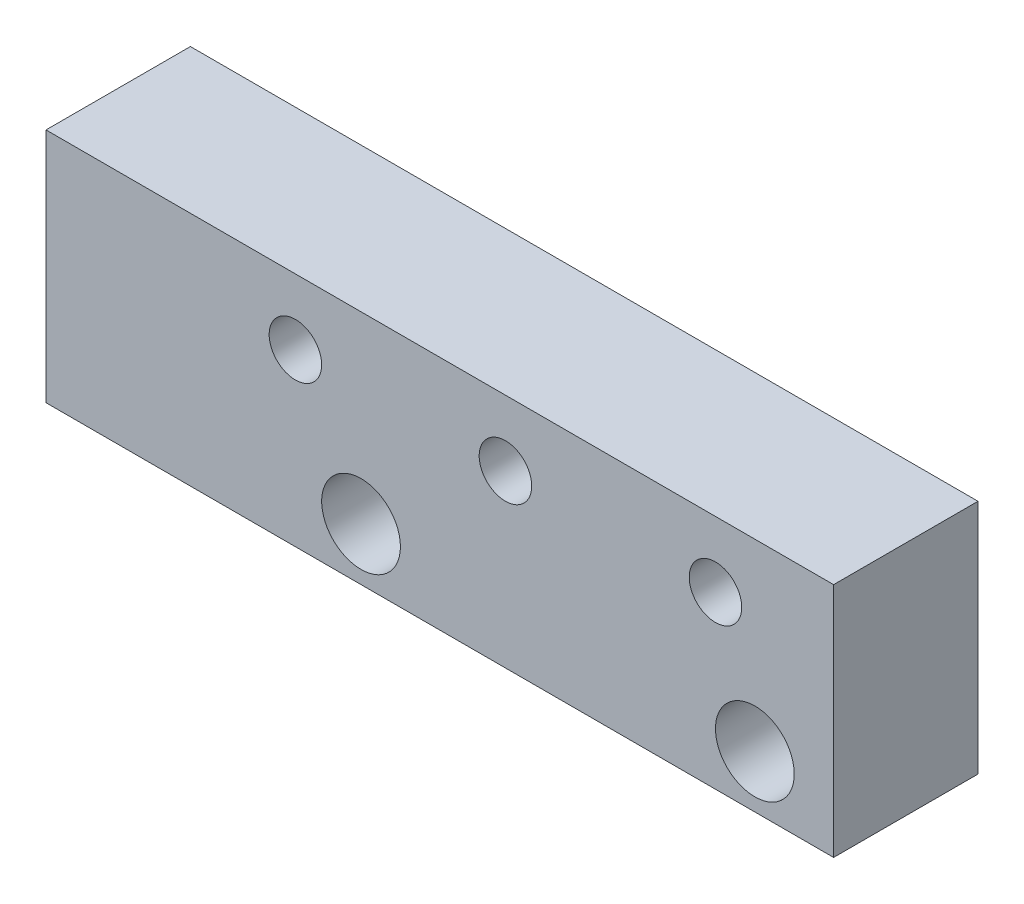
ISO-10303-21;
HEADER;
FILE_DESCRIPTION(('STEP AP214'),'2;1');
FILE_NAME('part.step','',(''),(''),'','','');
FILE_SCHEMA(('AUTOMOTIVE_DESIGN { 1 0 10303 214 1 1 1 1 }'));
ENDSEC;
DATA;
#1=APPLICATION_CONTEXT('core data for automotive mechanical design processes');
#2=APPLICATION_PROTOCOL_DEFINITION('international standard','automotive_design',2000,#1);
#3=PRODUCT_CONTEXT('',#1,'mechanical');
#4=PRODUCT('Part','Part','',(#3));
#5=PRODUCT_RELATED_PRODUCT_CATEGORY('part','',(#4));
#6=PRODUCT_DEFINITION_FORMATION('','',#4);
#7=PRODUCT_DEFINITION_CONTEXT('part definition',#1,'design');
#8=PRODUCT_DEFINITION('design','',#6,#7);
#9=PRODUCT_DEFINITION_SHAPE('','',#8);
#10=(LENGTH_UNIT() NAMED_UNIT(*) SI_UNIT(.MILLI.,.METRE.));
#11=(NAMED_UNIT(*) PLANE_ANGLE_UNIT() SI_UNIT($,.RADIAN.));
#12=(NAMED_UNIT(*) SI_UNIT($,.STERADIAN.) SOLID_ANGLE_UNIT());
#13=UNCERTAINTY_MEASURE_WITH_UNIT(LENGTH_MEASURE(1.E-05),#10,'distance_accuracy_value','');
#14=(GEOMETRIC_REPRESENTATION_CONTEXT(3) GLOBAL_UNCERTAINTY_ASSIGNED_CONTEXT((#13)) GLOBAL_UNIT_ASSIGNED_CONTEXT((#10,
#11,#12)) REPRESENTATION_CONTEXT('',''));
#15=CARTESIAN_POINT('',(0.,0.,0.));
#16=DIRECTION('',(0.,0.,1.));
#17=DIRECTION('',(1.,0.,0.));
#18=AXIS2_PLACEMENT_3D('',#15,#16,#17);
#19=CARTESIAN_POINT('',(-19.191314489822,2.80341880341881,5.5));
#20=DIRECTION('',(1.,0.,0.));
#21=DIRECTION('',(0.,0.,-1.));
#22=AXIS2_PLACEMENT_3D('',#19,#20,#21);
#23=PLANE('',#22);
#24=DIRECTION('',(0.,-1.,0.));
#25=VECTOR('',#24,1.);
#26=CARTESIAN_POINT('',(-19.191314489822,2.80341880341881,0.));
#27=LINE('',#26,#25);
#28=CARTESIAN_POINT('',(-19.191314489822,2.80341880341881,0.));
#29=VERTEX_POINT('',#28);
#30=CARTESIAN_POINT('',(-19.191314489822,-6.19658119658119,0.));
#31=VERTEX_POINT('',#30);
#32=EDGE_CURVE('E99',#29,#31,#27,.T.);
#33=ORIENTED_EDGE('',*,*,#32,.T.);
#34=DIRECTION('',(0.,0.,-1.));
#35=VECTOR('',#34,1.);
#36=CARTESIAN_POINT('',(-19.191314489822,-6.19658119658119,5.5));
#37=LINE('',#36,#35);
#38=CARTESIAN_POINT('',(-19.191314489822,-6.19658119658119,5.5));
#39=VERTEX_POINT('',#38);
#40=EDGE_CURVE('E11',#39,#31,#37,.T.);
#41=ORIENTED_EDGE('',*,*,#40,.F.);
#42=DIRECTION('',(0.,-1.,0.));
#43=VECTOR('',#42,1.);
#44=CARTESIAN_POINT('',(-19.191314489822,2.80341880341881,5.5));
#45=LINE('',#44,#43);
#46=CARTESIAN_POINT('',(-19.191314489822,2.80341880341881,5.5));
#47=VERTEX_POINT('',#46);
#48=EDGE_CURVE('E86',#47,#39,#45,.T.);
#49=ORIENTED_EDGE('',*,*,#48,.F.);
#50=DIRECTION('',(0.,0.,-1.));
#51=VECTOR('',#50,1.);
#52=CARTESIAN_POINT('',(-19.191314489822,2.80341880341881,5.5));
#53=LINE('',#52,#51);
#54=EDGE_CURVE('E95',#47,#29,#53,.T.);
#55=ORIENTED_EDGE('',*,*,#54,.T.);
#56=EDGE_LOOP('',(#33,#41,#49,#55));
#57=FACE_BOUND('',#56,.T.);
#58=ADVANCED_FACE('F33',(#57),#23,.F.);
#59=CARTESIAN_POINT('',(-19.191314489822,-6.19658119658119,5.5));
#60=DIRECTION('',(0.,1.,0.));
#61=DIRECTION('',(0.,0.,1.));
#62=AXIS2_PLACEMENT_3D('',#59,#60,#61);
#63=PLANE('',#62);
#64=DIRECTION('',(1.,0.,0.));
#65=VECTOR('',#64,1.);
#66=CARTESIAN_POINT('',(-19.191314489822,-6.19658119658119,0.));
#67=LINE('',#66,#65);
#68=CARTESIAN_POINT('',(10.808685510178,-6.19658119658119,0.));
#69=VERTEX_POINT('',#68);
#70=EDGE_CURVE('E90',#31,#69,#67,.T.);
#71=ORIENTED_EDGE('',*,*,#70,.T.);
#72=DIRECTION('',(0.,0.,-1.));
#73=VECTOR('',#72,1.);
#74=CARTESIAN_POINT('',(10.808685510178,-6.19658119658119,5.5));
#75=LINE('',#74,#73);
#76=CARTESIAN_POINT('',(10.808685510178,-6.19658119658119,5.5));
#77=VERTEX_POINT('',#76);
#78=EDGE_CURVE('E42',#77,#69,#75,.T.);
#79=ORIENTED_EDGE('',*,*,#78,.F.);
#80=DIRECTION('',(1.,0.,0.));
#81=VECTOR('',#80,1.);
#82=CARTESIAN_POINT('',(-19.191314489822,-6.19658119658119,5.5));
#83=LINE('',#82,#81);
#84=EDGE_CURVE('E81',#39,#77,#83,.T.);
#85=ORIENTED_EDGE('',*,*,#84,.F.);
#86=ORIENTED_EDGE('',*,*,#40,.T.);
#87=EDGE_LOOP('',(#71,#79,#85,#86));
#88=FACE_BOUND('',#87,.T.);
#89=ADVANCED_FACE('F89',(#88),#63,.F.);
#90=CARTESIAN_POINT('',(10.808685510178,2.80341880341881,5.5));
#91=DIRECTION('',(-1.,0.,0.));
#92=DIRECTION('',(0.,0.,1.));
#93=AXIS2_PLACEMENT_3D('',#90,#91,#92);
#94=PLANE('',#93);
#95=DIRECTION('',(0.,1.,0.));
#96=VECTOR('',#95,1.);
#97=CARTESIAN_POINT('',(10.808685510178,2.80341880341881,0.));
#98=LINE('',#97,#96);
#99=CARTESIAN_POINT('',(10.808685510178,2.80341880341881,0.));
#100=VERTEX_POINT('',#99);
#101=EDGE_CURVE('E68',#69,#100,#98,.T.);
#102=ORIENTED_EDGE('',*,*,#101,.T.);
#103=DIRECTION('',(0.,0.,-1.));
#104=VECTOR('',#103,1.);
#105=CARTESIAN_POINT('',(10.808685510178,2.80341880341881,5.5));
#106=LINE('',#105,#104);
#107=CARTESIAN_POINT('',(10.808685510178,2.80341880341881,5.5));
#108=VERTEX_POINT('',#107);
#109=EDGE_CURVE('E91',#108,#100,#106,.T.);
#110=ORIENTED_EDGE('',*,*,#109,.F.);
#111=DIRECTION('',(0.,1.,0.));
#112=VECTOR('',#111,1.);
#113=CARTESIAN_POINT('',(10.808685510178,2.80341880341881,5.5));
#114=LINE('',#113,#112);
#115=EDGE_CURVE('E84',#77,#108,#114,.T.);
#116=ORIENTED_EDGE('',*,*,#115,.F.);
#117=ORIENTED_EDGE('',*,*,#78,.T.);
#118=EDGE_LOOP('',(#102,#110,#116,#117));
#119=FACE_BOUND('',#118,.T.);
#120=ADVANCED_FACE('F93',(#119),#94,.F.);
#121=CARTESIAN_POINT('',(-19.191314489822,2.80341880341881,5.5));
#122=DIRECTION('',(0.,-1.,0.));
#123=DIRECTION('',(0.,0.,-1.));
#124=AXIS2_PLACEMENT_3D('',#121,#122,#123);
#125=PLANE('',#124);
#126=DIRECTION('',(-1.,0.,0.));
#127=VECTOR('',#126,1.);
#128=CARTESIAN_POINT('',(-19.191314489822,2.80341880341881,0.));
#129=LINE('',#128,#127);
#130=EDGE_CURVE('E74',#100,#29,#129,.T.);
#131=ORIENTED_EDGE('',*,*,#130,.T.);
#132=ORIENTED_EDGE('',*,*,#54,.F.);
#133=DIRECTION('',(-1.,0.,0.));
#134=VECTOR('',#133,1.);
#135=CARTESIAN_POINT('',(-19.191314489822,2.80341880341881,5.5));
#136=LINE('',#135,#134);
#137=EDGE_CURVE('E51',#108,#47,#136,.T.);
#138=ORIENTED_EDGE('',*,*,#137,.F.);
#139=ORIENTED_EDGE('',*,*,#109,.T.);
#140=EDGE_LOOP('',(#131,#132,#138,#139));
#141=FACE_BOUND('',#140,.T.);
#142=ADVANCED_FACE('F142',(#141),#125,.F.);
#143=CARTESIAN_POINT('',(0.,0.,5.5));
#144=DIRECTION('',(0.,0.,1.));
#145=DIRECTION('',(1.,0.,0.));
#146=AXIS2_PLACEMENT_3D('',#143,#144,#145);
#147=PLANE('',#146);
#148=CARTESIAN_POINT('',(7.80868551017804,-4.19658119658119,5.5));
#149=DIRECTION('',(0.,0.,1.));
#150=DIRECTION('',(1.,0.,0.));
#151=AXIS2_PLACEMENT_3D('',#148,#149,#150);
#152=CIRCLE('',#151,1.5);
#153=CARTESIAN_POINT('',(9.30868551017804,-4.19658119658119,5.5));
#154=VERTEX_POINT('',#153);
#155=EDGE_CURVE('E121',#154,#154,#152,.T.);
#156=ORIENTED_EDGE('',*,*,#155,.F.);
#157=EDGE_LOOP('',(#156));
#158=FACE_BOUND('',#157,.T.);
#159=CARTESIAN_POINT('',(-7.19131448982195,-4.19658119658119,5.5));
#160=DIRECTION('',(0.,0.,1.));
#161=DIRECTION('',(1.,0.,0.));
#162=AXIS2_PLACEMENT_3D('',#159,#160,#161);
#163=CIRCLE('',#162,1.5);
#164=CARTESIAN_POINT('',(-5.69131448982195,-4.19658119658119,5.5));
#165=VERTEX_POINT('',#164);
#166=EDGE_CURVE('E110',#165,#165,#163,.T.);
#167=ORIENTED_EDGE('',*,*,#166,.F.);
#168=EDGE_LOOP('',(#167));
#169=FACE_BOUND('',#168,.T.);
#170=CARTESIAN_POINT('',(-1.69131448982196,0.303418803418805,5.5));
#171=DIRECTION('',(0.,0.,1.));
#172=DIRECTION('',(1.,0.,0.));
#173=AXIS2_PLACEMENT_3D('',#170,#171,#172);
#174=CIRCLE('',#173,1.);
#175=CARTESIAN_POINT('',(-0.691314489821957,0.303418803418805,5.5));
#176=VERTEX_POINT('',#175);
#177=EDGE_CURVE('E109',#176,#176,#174,.T.);
#178=ORIENTED_EDGE('',*,*,#177,.F.);
#179=EDGE_LOOP('',(#178));
#180=FACE_BOUND('',#179,.T.);
#181=CARTESIAN_POINT('',(-9.69131448982196,0.303418803418805,5.5));
#182=DIRECTION('',(0.,0.,1.));
#183=DIRECTION('',(1.,0.,0.));
#184=AXIS2_PLACEMENT_3D('',#181,#182,#183);
#185=CIRCLE('',#184,1.);
#186=CARTESIAN_POINT('',(-8.69131448982196,0.303418803418805,5.5));
#187=VERTEX_POINT('',#186);
#188=EDGE_CURVE('E125',#187,#187,#185,.T.);
#189=ORIENTED_EDGE('',*,*,#188,.F.);
#190=EDGE_LOOP('',(#189));
#191=FACE_BOUND('',#190,.T.);
#192=CARTESIAN_POINT('',(6.30868551017804,0.303418803418805,5.5));
#193=DIRECTION('',(0.,0.,1.));
#194=DIRECTION('',(1.,0.,0.));
#195=AXIS2_PLACEMENT_3D('',#192,#193,#194);
#196=CIRCLE('',#195,1.);
#197=CARTESIAN_POINT('',(7.30868551017805,0.303418803418805,5.5));
#198=VERTEX_POINT('',#197);
#199=EDGE_CURVE('E130',#198,#198,#196,.T.);
#200=ORIENTED_EDGE('',*,*,#199,.F.);
#201=EDGE_LOOP('',(#200));
#202=FACE_BOUND('',#201,.T.);
#203=ORIENTED_EDGE('',*,*,#48,.T.);
#204=ORIENTED_EDGE('',*,*,#84,.T.);
#205=ORIENTED_EDGE('',*,*,#115,.T.);
#206=ORIENTED_EDGE('',*,*,#137,.T.);
#207=EDGE_LOOP('',(#203,#204,#205,#206));
#208=FACE_BOUND('',#207,.T.);
#209=ADVANCED_FACE('F82',(#158,#169,#180,#191,#202,#208),#147,.T.);
#210=CARTESIAN_POINT('',(0.,0.,0.));
#211=DIRECTION('',(0.,0.,1.));
#212=DIRECTION('',(1.,0.,0.));
#213=AXIS2_PLACEMENT_3D('',#210,#211,#212);
#214=PLANE('',#213);
#215=CARTESIAN_POINT('',(7.80868551017804,-4.19658119658119,0.));
#216=DIRECTION('',(0.,0.,1.));
#217=DIRECTION('',(1.,0.,0.));
#218=AXIS2_PLACEMENT_3D('',#215,#216,#217);
#219=CIRCLE('',#218,1.5);
#220=CARTESIAN_POINT('',(9.30868551017804,-4.19658119658119,0.));
#221=VERTEX_POINT('',#220);
#222=EDGE_CURVE('E36',#221,#221,#219,.T.);
#223=ORIENTED_EDGE('',*,*,#222,.T.);
#224=EDGE_LOOP('',(#223));
#225=FACE_BOUND('',#224,.T.);
#226=CARTESIAN_POINT('',(-7.19131448982195,-4.19658119658119,0.));
#227=DIRECTION('',(0.,0.,1.));
#228=DIRECTION('',(1.,0.,0.));
#229=AXIS2_PLACEMENT_3D('',#226,#227,#228);
#230=CIRCLE('',#229,1.5);
#231=CARTESIAN_POINT('',(-5.69131448982195,-4.19658119658119,0.));
#232=VERTEX_POINT('',#231);
#233=EDGE_CURVE('E107',#232,#232,#230,.T.);
#234=ORIENTED_EDGE('',*,*,#233,.T.);
#235=EDGE_LOOP('',(#234));
#236=FACE_BOUND('',#235,.T.);
#237=CARTESIAN_POINT('',(-1.69131448982196,0.303418803418805,0.));
#238=DIRECTION('',(0.,0.,1.));
#239=DIRECTION('',(1.,0.,0.));
#240=AXIS2_PLACEMENT_3D('',#237,#238,#239);
#241=CIRCLE('',#240,1.);
#242=CARTESIAN_POINT('',(-0.691314489821957,0.303418803418805,0.));
#243=VERTEX_POINT('',#242);
#244=EDGE_CURVE('E114',#243,#243,#241,.T.);
#245=ORIENTED_EDGE('',*,*,#244,.T.);
#246=EDGE_LOOP('',(#245));
#247=FACE_BOUND('',#246,.T.);
#248=CARTESIAN_POINT('',(-9.69131448982196,0.303418803418805,0.));
#249=DIRECTION('',(0.,0.,1.));
#250=DIRECTION('',(1.,0.,0.));
#251=AXIS2_PLACEMENT_3D('',#248,#249,#250);
#252=CIRCLE('',#251,1.);
#253=CARTESIAN_POINT('',(-8.69131448982196,0.303418803418805,0.));
#254=VERTEX_POINT('',#253);
#255=EDGE_CURVE('E127',#254,#254,#252,.T.);
#256=ORIENTED_EDGE('',*,*,#255,.T.);
#257=EDGE_LOOP('',(#256));
#258=FACE_BOUND('',#257,.T.);
#259=CARTESIAN_POINT('',(6.30868551017804,0.303418803418805,0.));
#260=DIRECTION('',(0.,0.,1.));
#261=DIRECTION('',(1.,0.,0.));
#262=AXIS2_PLACEMENT_3D('',#259,#260,#261);
#263=CIRCLE('',#262,1.);
#264=CARTESIAN_POINT('',(7.30868551017805,0.303418803418805,0.));
#265=VERTEX_POINT('',#264);
#266=EDGE_CURVE('E102',#265,#265,#263,.T.);
#267=ORIENTED_EDGE('',*,*,#266,.T.);
#268=EDGE_LOOP('',(#267));
#269=FACE_BOUND('',#268,.T.);
#270=ORIENTED_EDGE('',*,*,#32,.F.);
#271=ORIENTED_EDGE('',*,*,#130,.F.);
#272=ORIENTED_EDGE('',*,*,#101,.F.);
#273=ORIENTED_EDGE('',*,*,#70,.F.);
#274=EDGE_LOOP('',(#270,#271,#272,#273));
#275=FACE_BOUND('',#274,.T.);
#276=ADVANCED_FACE('F141',(#225,#236,#247,#258,#269,#275),#214,.F.);
#277=CARTESIAN_POINT('',(6.30868551017804,0.303418803418805,0.));
#278=DIRECTION('',(0.,0.,1.));
#279=DIRECTION('',(1.,0.,0.));
#280=AXIS2_PLACEMENT_3D('',#277,#278,#279);
#281=CYLINDRICAL_SURFACE('',#280,1.);
#282=ORIENTED_EDGE('',*,*,#266,.F.);
#283=EDGE_LOOP('',(#282));
#284=FACE_BOUND('',#283,.T.);
#285=ORIENTED_EDGE('',*,*,#199,.T.);
#286=EDGE_LOOP('',(#285));
#287=FACE_BOUND('',#286,.T.);
#288=ADVANCED_FACE('F138',(#284,#287),#281,.F.);
#289=CARTESIAN_POINT('',(-9.69131448982196,0.303418803418805,0.));
#290=DIRECTION('',(0.,0.,1.));
#291=DIRECTION('',(1.,0.,0.));
#292=AXIS2_PLACEMENT_3D('',#289,#290,#291);
#293=CYLINDRICAL_SURFACE('',#292,1.);
#294=ORIENTED_EDGE('',*,*,#255,.F.);
#295=EDGE_LOOP('',(#294));
#296=FACE_BOUND('',#295,.T.);
#297=ORIENTED_EDGE('',*,*,#188,.T.);
#298=EDGE_LOOP('',(#297));
#299=FACE_BOUND('',#298,.T.);
#300=ADVANCED_FACE('F182',(#296,#299),#293,.F.);
#301=CARTESIAN_POINT('',(-1.69131448982196,0.303418803418805,0.));
#302=DIRECTION('',(0.,0.,1.));
#303=DIRECTION('',(1.,0.,0.));
#304=AXIS2_PLACEMENT_3D('',#301,#302,#303);
#305=CYLINDRICAL_SURFACE('',#304,1.);
#306=ORIENTED_EDGE('',*,*,#244,.F.);
#307=EDGE_LOOP('',(#306));
#308=FACE_BOUND('',#307,.T.);
#309=ORIENTED_EDGE('',*,*,#177,.T.);
#310=EDGE_LOOP('',(#309));
#311=FACE_BOUND('',#310,.T.);
#312=ADVANCED_FACE('F192',(#308,#311),#305,.F.);
#313=CARTESIAN_POINT('',(-7.19131448982195,-4.19658119658119,-4.5));
#314=DIRECTION('',(0.,0.,1.));
#315=DIRECTION('',(1.,0.,0.));
#316=AXIS2_PLACEMENT_3D('',#313,#314,#315);
#317=CYLINDRICAL_SURFACE('',#316,1.5);
#318=ORIENTED_EDGE('',*,*,#166,.T.);
#319=EDGE_LOOP('',(#318));
#320=FACE_BOUND('',#319,.T.);
#321=ORIENTED_EDGE('',*,*,#233,.F.);
#322=EDGE_LOOP('',(#321));
#323=FACE_BOUND('',#322,.T.);
#324=ADVANCED_FACE('F201',(#320,#323),#317,.F.);
#325=CARTESIAN_POINT('',(7.80868551017804,-4.19658119658119,-4.5));
#326=DIRECTION('',(0.,0.,1.));
#327=DIRECTION('',(1.,0.,0.));
#328=AXIS2_PLACEMENT_3D('',#325,#326,#327);
#329=CYLINDRICAL_SURFACE('',#328,1.5);
#330=ORIENTED_EDGE('',*,*,#155,.T.);
#331=EDGE_LOOP('',(#330));
#332=FACE_BOUND('',#331,.T.);
#333=ORIENTED_EDGE('',*,*,#222,.F.);
#334=EDGE_LOOP('',(#333));
#335=FACE_BOUND('',#334,.T.);
#336=ADVANCED_FACE('F220',(#332,#335),#329,.F.);
#337=CLOSED_SHELL('',(#58,#89,#120,#142,#209,#276,#288,#300,#312,#324,#336));
#338=MANIFOLD_SOLID_BREP('B2',#337);
#339=ADVANCED_BREP_SHAPE_REPRESENTATION('',(#18,#338),#14);
#340=SHAPE_DEFINITION_REPRESENTATION(#9,#339);
ENDSEC;
END-ISO-10303-21;
